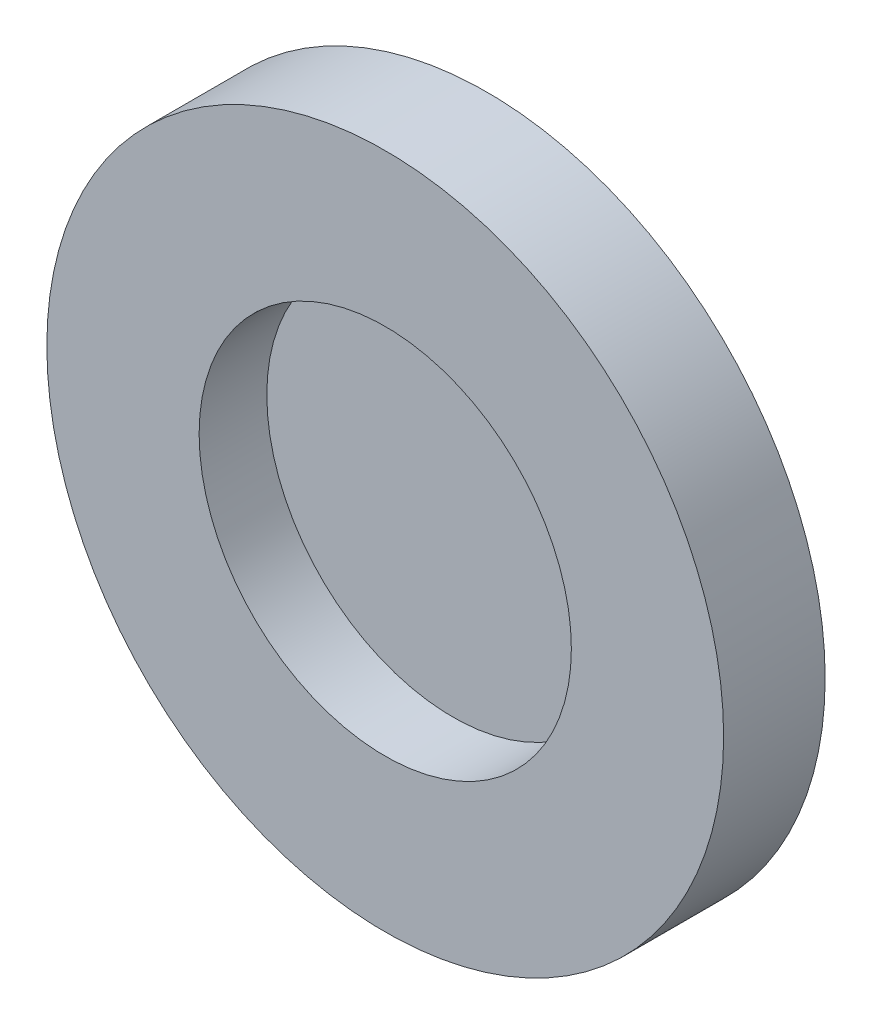
ISO-10303-21;
HEADER;
FILE_DESCRIPTION(('STEP AP214'),'2;1');
FILE_NAME('part.step','',(''),(''),'','','');
FILE_SCHEMA(('AUTOMOTIVE_DESIGN { 1 0 10303 214 1 1 1 1 }'));
ENDSEC;
DATA;
#1=APPLICATION_CONTEXT('core data for automotive mechanical design processes');
#2=APPLICATION_PROTOCOL_DEFINITION('international standard','automotive_design',2000,#1);
#3=PRODUCT_CONTEXT('',#1,'mechanical');
#4=PRODUCT('Part','Part','',(#3));
#5=PRODUCT_RELATED_PRODUCT_CATEGORY('part','',(#4));
#6=PRODUCT_DEFINITION_FORMATION('','',#4);
#7=PRODUCT_DEFINITION_CONTEXT('part definition',#1,'design');
#8=PRODUCT_DEFINITION('design','',#6,#7);
#9=PRODUCT_DEFINITION_SHAPE('','',#8);
#10=(LENGTH_UNIT() NAMED_UNIT(*) SI_UNIT(.MILLI.,.METRE.));
#11=(NAMED_UNIT(*) PLANE_ANGLE_UNIT() SI_UNIT($,.RADIAN.));
#12=(NAMED_UNIT(*) SI_UNIT($,.STERADIAN.) SOLID_ANGLE_UNIT());
#13=UNCERTAINTY_MEASURE_WITH_UNIT(LENGTH_MEASURE(1.E-05),#10,'distance_accuracy_value','');
#14=(GEOMETRIC_REPRESENTATION_CONTEXT(3) GLOBAL_UNCERTAINTY_ASSIGNED_CONTEXT((#13)) GLOBAL_UNIT_ASSIGNED_CONTEXT((#10,
#11,#12)) REPRESENTATION_CONTEXT('',''));
#15=CARTESIAN_POINT('',(0.,0.,0.));
#16=DIRECTION('',(0.,0.,1.));
#17=DIRECTION('',(1.,0.,0.));
#18=AXIS2_PLACEMENT_3D('',#15,#16,#17);
#19=CARTESIAN_POINT('',(0.,0.,2.));
#20=DIRECTION('',(0.,0.,1.));
#21=DIRECTION('',(1.,0.,0.));
#22=AXIS2_PLACEMENT_3D('',#19,#20,#21);
#23=PLANE('',#22);
#24=CARTESIAN_POINT('',(0.,0.,2.));
#25=DIRECTION('',(0.,0.,1.));
#26=DIRECTION('',(1.,0.,0.));
#27=AXIS2_PLACEMENT_3D('',#24,#25,#26);
#28=CIRCLE('',#27,10.);
#29=CARTESIAN_POINT('',(10.,0.,2.));
#30=VERTEX_POINT('',#29);
#31=EDGE_CURVE('E10',#30,#30,#28,.T.);
#32=ORIENTED_EDGE('',*,*,#31,.T.);
#33=EDGE_LOOP('',(#32));
#34=FACE_BOUND('',#33,.T.);
#35=CARTESIAN_POINT('',(0.,0.,2.));
#36=DIRECTION('',(0.,0.,1.));
#37=DIRECTION('',(1.,0.,0.));
#38=AXIS2_PLACEMENT_3D('',#35,#36,#37);
#39=CIRCLE('',#38,5.5);
#40=CARTESIAN_POINT('',(5.5,0.,2.));
#41=VERTEX_POINT('',#40);
#42=EDGE_CURVE('E38',#41,#41,#39,.T.);
#43=ORIENTED_EDGE('',*,*,#42,.F.);
#44=EDGE_LOOP('',(#43));
#45=FACE_BOUND('',#44,.T.);
#46=ADVANCED_FACE('F31',(#34,#45),#23,.T.);
#47=CARTESIAN_POINT('',(0.,0.,2.));
#48=DIRECTION('',(0.,0.,-1.));
#49=DIRECTION('',(-1.,0.,0.));
#50=AXIS2_PLACEMENT_3D('',#47,#48,#49);
#51=CYLINDRICAL_SURFACE('',#50,10.);
#52=ORIENTED_EDGE('',*,*,#31,.F.);
#53=EDGE_LOOP('',(#52));
#54=FACE_BOUND('',#53,.T.);
#55=CARTESIAN_POINT('',(0.,0.,-1.));
#56=DIRECTION('',(0.,0.,-1.));
#57=DIRECTION('',(-1.,0.,0.));
#58=AXIS2_PLACEMENT_3D('',#55,#56,#57);
#59=CIRCLE('',#58,10.);
#60=CARTESIAN_POINT('',(-10.,0.,-1.));
#61=VERTEX_POINT('',#60);
#62=EDGE_CURVE('E47',#61,#61,#59,.T.);
#63=ORIENTED_EDGE('',*,*,#62,.F.);
#64=EDGE_LOOP('',(#63));
#65=FACE_BOUND('',#64,.T.);
#66=ADVANCED_FACE('F33',(#54,#65),#51,.T.);
#67=CARTESIAN_POINT('',(0.,0.,2.));
#68=DIRECTION('',(0.,0.,-1.));
#69=DIRECTION('',(-1.,0.,0.));
#70=AXIS2_PLACEMENT_3D('',#67,#68,#69);
#71=CYLINDRICAL_SURFACE('',#70,5.5);
#72=ORIENTED_EDGE('',*,*,#42,.T.);
#73=EDGE_LOOP('',(#72));
#74=FACE_BOUND('',#73,.T.);
#75=CARTESIAN_POINT('',(0.,0.,0.));
#76=DIRECTION('',(0.,0.,1.));
#77=DIRECTION('',(1.,0.,0.));
#78=AXIS2_PLACEMENT_3D('',#75,#76,#77);
#79=CIRCLE('',#78,5.5);
#80=CARTESIAN_POINT('',(5.5,0.,0.));
#81=VERTEX_POINT('',#80);
#82=EDGE_CURVE('E42',#81,#81,#79,.T.);
#83=ORIENTED_EDGE('',*,*,#82,.F.);
#84=EDGE_LOOP('',(#83));
#85=FACE_BOUND('',#84,.T.);
#86=ADVANCED_FACE('F55',(#74,#85),#71,.F.);
#87=CARTESIAN_POINT('',(0.,0.,0.));
#88=DIRECTION('',(0.,0.,-1.));
#89=DIRECTION('',(-1.,0.,0.));
#90=AXIS2_PLACEMENT_3D('',#87,#88,#89);
#91=PLANE('',#90);
#92=ORIENTED_EDGE('',*,*,#82,.T.);
#93=EDGE_LOOP('',(#92));
#94=FACE_BOUND('',#93,.T.);
#95=ADVANCED_FACE('F61',(#94),#91,.F.);
#96=CARTESIAN_POINT('',(0.,0.,-1.));
#97=DIRECTION('',(0.,0.,-1.));
#98=DIRECTION('',(-1.,0.,0.));
#99=AXIS2_PLACEMENT_3D('',#96,#97,#98);
#100=PLANE('',#99);
#101=ORIENTED_EDGE('',*,*,#62,.T.);
#102=EDGE_LOOP('',(#101));
#103=FACE_BOUND('',#102,.T.);
#104=ADVANCED_FACE('F52',(#103),#100,.T.);
#105=CLOSED_SHELL('',(#46,#66,#86,#95,#104));
#106=MANIFOLD_SOLID_BREP('B2',#105);
#107=ADVANCED_BREP_SHAPE_REPRESENTATION('',(#18,#106),#14);
#108=SHAPE_DEFINITION_REPRESENTATION(#9,#107);
ENDSEC;
END-ISO-10303-21;
